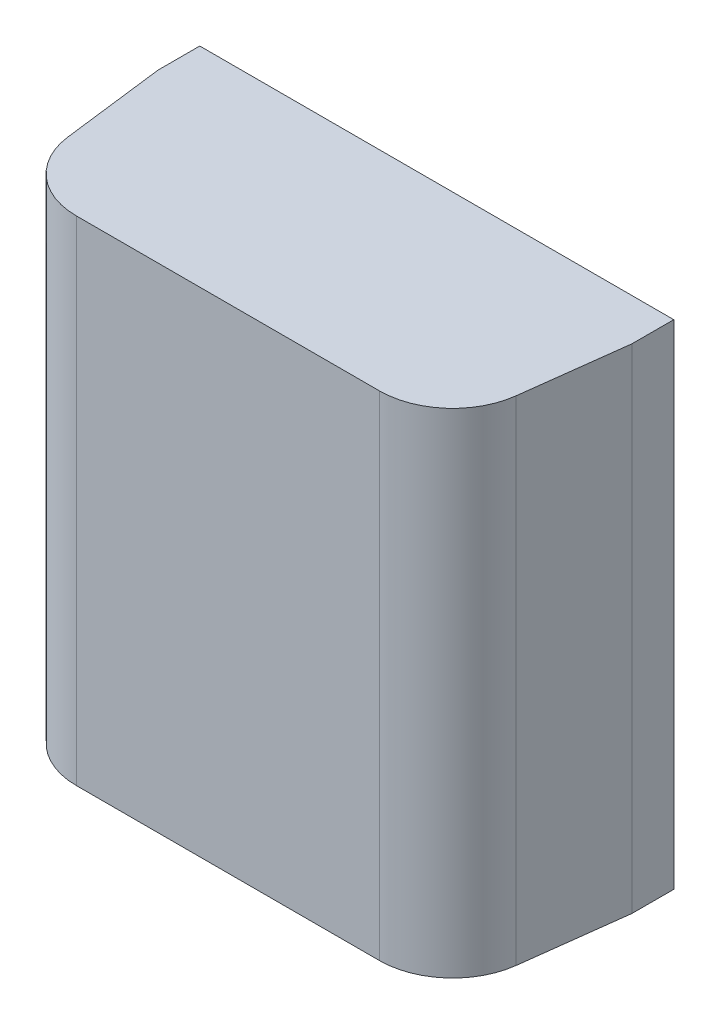
ISO-10303-21;
HEADER;
FILE_DESCRIPTION(('STEP AP214'),'2;1');
FILE_NAME('part.step','',(''),(''),'','','');
FILE_SCHEMA(('AUTOMOTIVE_DESIGN { 1 0 10303 214 1 1 1 1 }'));
ENDSEC;
DATA;
#1=APPLICATION_CONTEXT('core data for automotive mechanical design processes');
#2=APPLICATION_PROTOCOL_DEFINITION('international standard','automotive_design',2000,#1);
#3=PRODUCT_CONTEXT('',#1,'mechanical');
#4=PRODUCT('Part','Part','',(#3));
#5=PRODUCT_RELATED_PRODUCT_CATEGORY('part','',(#4));
#6=PRODUCT_DEFINITION_FORMATION('','',#4);
#7=PRODUCT_DEFINITION_CONTEXT('part definition',#1,'design');
#8=PRODUCT_DEFINITION('design','',#6,#7);
#9=PRODUCT_DEFINITION_SHAPE('','',#8);
#10=(LENGTH_UNIT() NAMED_UNIT(*) SI_UNIT(.MILLI.,.METRE.));
#11=(NAMED_UNIT(*) PLANE_ANGLE_UNIT() SI_UNIT($,.RADIAN.));
#12=(NAMED_UNIT(*) SI_UNIT($,.STERADIAN.) SOLID_ANGLE_UNIT());
#13=UNCERTAINTY_MEASURE_WITH_UNIT(LENGTH_MEASURE(1.E-05),#10,'distance_accuracy_value','');
#14=(GEOMETRIC_REPRESENTATION_CONTEXT(3) GLOBAL_UNCERTAINTY_ASSIGNED_CONTEXT((#13)) GLOBAL_UNIT_ASSIGNED_CONTEXT((#10,
#11,#12)) REPRESENTATION_CONTEXT('',''));
#15=CARTESIAN_POINT('',(0.,0.,0.));
#16=DIRECTION('',(0.,0.,1.));
#17=DIRECTION('',(1.,0.,0.));
#18=AXIS2_PLACEMENT_3D('',#15,#16,#17);
#19=CARTESIAN_POINT('',(0.362934712614328,-0.14766176900041,0.875));
#20=DIRECTION('',(0.,-1.,0.));
#21=DIRECTION('',(0.661802563235741,0.,0.749678175815866));
#22=AXIS2_PLACEMENT_3D('',#19,#20,#21);
#23=CYLINDRICAL_SURFACE('',#22,0.175);
#24=CARTESIAN_POINT('',(0.362934712614328,-0.590647076001639,0.875));
#25=DIRECTION('',(0.,1.,0.));
#26=DIRECTION('',(0.661802563235741,0.,0.749678175815866));
#27=AXIS2_PLACEMENT_3D('',#24,#25,#26);
#28=CIRCLE('',#27,0.175);
#29=CARTESIAN_POINT('',(0.362934712614328,-0.590647076001639,1.05));
#30=VERTEX_POINT('',#29);
#31=CARTESIAN_POINT('',(0.53658334103922,-0.590647076001639,0.896706078553112));
#32=VERTEX_POINT('',#31);
#33=EDGE_CURVE('E11',#30,#32,#28,.T.);
#34=ORIENTED_EDGE('',*,*,#33,.T.);
#35=DIRECTION('',(0.,1.,0.));
#36=VECTOR('',#35,1.);
#37=CARTESIAN_POINT('',(0.53658334103922,-0.14766176900041,0.896706078553112));
#38=LINE('',#37,#36);
#39=CARTESIAN_POINT('',(0.53658334103922,0.590647076001639,0.896706078553112));
#40=VERTEX_POINT('',#39);
#41=EDGE_CURVE('E25',#32,#40,#38,.T.);
#42=ORIENTED_EDGE('',*,*,#41,.T.);
#43=CARTESIAN_POINT('',(0.362934712614328,0.590647076001639,0.875));
#44=DIRECTION('',(0.,-1.,0.));
#45=DIRECTION('',(0.661802563235741,0.,0.749678175815866));
#46=AXIS2_PLACEMENT_3D('',#43,#44,#45);
#47=CIRCLE('',#46,0.175);
#48=CARTESIAN_POINT('',(0.362934712614328,0.590647076001639,1.05));
#49=VERTEX_POINT('',#48);
#50=EDGE_CURVE('E48',#40,#49,#47,.T.);
#51=ORIENTED_EDGE('',*,*,#50,.T.);
#52=DIRECTION('',(0.,-1.,0.));
#53=VECTOR('',#52,1.);
#54=CARTESIAN_POINT('',(0.362934712614328,-0.14766176900041,1.05));
#55=LINE('',#54,#53);
#56=EDGE_CURVE('E146',#49,#30,#55,.T.);
#57=ORIENTED_EDGE('',*,*,#56,.T.);
#58=EDGE_LOOP('',(#34,#42,#51,#57));
#59=FACE_BOUND('',#58,.T.);
#60=ADVANCED_FACE('F16',(#59),#23,.T.);
#61=CARTESIAN_POINT('',(-0.567421600858359,-0.590647076001639,0.55));
#62=DIRECTION('',(0.,-1.,0.));
#63=DIRECTION('',(0.,0.,-1.));
#64=AXIS2_PLACEMENT_3D('',#61,#62,#63);
#65=PLANE('',#64);
#66=ORIENTED_EDGE('',*,*,#33,.F.);
#67=DIRECTION('',(1.,0.,0.));
#68=VECTOR('',#67,1.);
#69=CARTESIAN_POINT('',(0.567421600858359,-0.590647076001639,1.05));
#70=LINE('',#69,#68);
#71=CARTESIAN_POINT('',(-0.362934712614328,-0.590647076001639,1.05));
#72=VERTEX_POINT('',#71);
#73=EDGE_CURVE('E154',#72,#30,#70,.T.);
#74=ORIENTED_EDGE('',*,*,#73,.F.);
#75=CARTESIAN_POINT('',(-0.362934712614328,-0.590647076001639,0.875));
#76=DIRECTION('',(0.,1.,0.));
#77=DIRECTION('',(-0.661802563235741,0.,0.749678175815866));
#78=AXIS2_PLACEMENT_3D('',#75,#76,#77);
#79=CIRCLE('',#78,0.175);
#80=CARTESIAN_POINT('',(-0.53658334103922,-0.590647076001639,0.896706078553112));
#81=VERTEX_POINT('',#80);
#82=EDGE_CURVE('E157',#81,#72,#79,.T.);
#83=ORIENTED_EDGE('',*,*,#82,.F.);
#84=DIRECTION('',(0.124034734589209,0.,0.992277876713668));
#85=VECTOR('',#84,1.);
#86=CARTESIAN_POINT('',(-0.561075447012205,-0.590647076001639,0.700769230769231));
#87=LINE('',#86,#85);
#88=CARTESIAN_POINT('',(-0.567421600858359,-0.590647076001639,0.65));
#89=VERTEX_POINT('',#88);
#90=EDGE_CURVE('E130',#89,#81,#87,.T.);
#91=ORIENTED_EDGE('',*,*,#90,.F.);
#92=DIRECTION('',(0.,0.,1.));
#93=VECTOR('',#92,1.);
#94=CARTESIAN_POINT('',(-0.567421600858359,-0.590647076001639,0.55));
#95=LINE('',#94,#93);
#96=CARTESIAN_POINT('',(-0.567421600858359,-0.590647076001639,0.55));
#97=VERTEX_POINT('',#96);
#98=EDGE_CURVE('E114',#97,#89,#95,.T.);
#99=ORIENTED_EDGE('',*,*,#98,.F.);
#100=DIRECTION('',(-1.,0.,0.));
#101=VECTOR('',#100,1.);
#102=CARTESIAN_POINT('',(0.567421600858359,-0.590647076001639,0.55));
#103=LINE('',#102,#101);
#104=CARTESIAN_POINT('',(0.567421600858359,-0.590647076001639,0.55));
#105=VERTEX_POINT('',#104);
#106=EDGE_CURVE('E119',#105,#97,#103,.T.);
#107=ORIENTED_EDGE('',*,*,#106,.F.);
#108=DIRECTION('',(0.,0.,1.));
#109=VECTOR('',#108,1.);
#110=CARTESIAN_POINT('',(0.567421600858359,-0.590647076001639,0.55));
#111=LINE('',#110,#109);
#112=CARTESIAN_POINT('',(0.567421600858359,-0.590647076001639,0.65));
#113=VERTEX_POINT('',#112);
#114=EDGE_CURVE('E149',#105,#113,#111,.T.);
#115=ORIENTED_EDGE('',*,*,#114,.T.);
#116=DIRECTION('',(0.124034734589209,0.,-0.992277876713668));
#117=VECTOR('',#116,1.);
#118=CARTESIAN_POINT('',(0.552345883922077,-0.590647076001639,0.77060573549026));
#119=LINE('',#118,#117);
#120=EDGE_CURVE('E162',#32,#113,#119,.T.);
#121=ORIENTED_EDGE('',*,*,#120,.F.);
#122=EDGE_LOOP('',(#66,#74,#83,#91,#99,#107,#115,#121));
#123=FACE_BOUND('',#122,.T.);
#124=ADVANCED_FACE('F128',(#123),#65,.T.);
#125=CARTESIAN_POINT('',(0.,0.,1.05));
#126=DIRECTION('',(0.,0.,1.));
#127=DIRECTION('',(1.,0.,0.));
#128=AXIS2_PLACEMENT_3D('',#125,#126,#127);
#129=PLANE('',#128);
#130=ORIENTED_EDGE('',*,*,#56,.F.);
#131=DIRECTION('',(-1.,0.,0.));
#132=VECTOR('',#131,1.);
#133=CARTESIAN_POINT('',(-0.567421600858359,0.590647076001639,1.05));
#134=LINE('',#133,#132);
#135=CARTESIAN_POINT('',(-0.362934712614328,0.590647076001639,1.05));
#136=VERTEX_POINT('',#135);
#137=EDGE_CURVE('E150',#49,#136,#134,.T.);
#138=ORIENTED_EDGE('',*,*,#137,.T.);
#139=DIRECTION('',(0.,1.,0.));
#140=VECTOR('',#139,1.);
#141=CARTESIAN_POINT('',(-0.362934712614328,0.14766176900041,1.05));
#142=LINE('',#141,#140);
#143=EDGE_CURVE('E161',#72,#136,#142,.T.);
#144=ORIENTED_EDGE('',*,*,#143,.F.);
#145=ORIENTED_EDGE('',*,*,#73,.T.);
#146=EDGE_LOOP('',(#130,#138,#144,#145));
#147=FACE_BOUND('',#146,.T.);
#148=ADVANCED_FACE('F209',(#147),#129,.T.);
#149=CARTESIAN_POINT('',(-0.362934712614328,0.14766176900041,0.875));
#150=DIRECTION('',(0.,1.,0.));
#151=DIRECTION('',(-0.661802563235741,0.,0.749678175815866));
#152=AXIS2_PLACEMENT_3D('',#149,#150,#151);
#153=CYLINDRICAL_SURFACE('',#152,0.175);
#154=CARTESIAN_POINT('',(-0.362934712614328,0.590647076001639,0.875));
#155=DIRECTION('',(0.,-1.,0.));
#156=DIRECTION('',(-0.661802563235741,0.,0.749678175815866));
#157=AXIS2_PLACEMENT_3D('',#154,#155,#156);
#158=CIRCLE('',#157,0.175);
#159=CARTESIAN_POINT('',(-0.53658334103922,0.590647076001639,0.896706078553112));
#160=VERTEX_POINT('',#159);
#161=EDGE_CURVE('E169',#136,#160,#158,.T.);
#162=ORIENTED_EDGE('',*,*,#161,.T.);
#163=DIRECTION('',(0.,-1.,0.));
#164=VECTOR('',#163,1.);
#165=CARTESIAN_POINT('',(-0.53658334103922,0.14766176900041,0.896706078553112));
#166=LINE('',#165,#164);
#167=EDGE_CURVE('E160',#160,#81,#166,.T.);
#168=ORIENTED_EDGE('',*,*,#167,.T.);
#169=ORIENTED_EDGE('',*,*,#82,.T.);
#170=ORIENTED_EDGE('',*,*,#143,.T.);
#171=EDGE_LOOP('',(#162,#168,#169,#170));
#172=FACE_BOUND('',#171,.T.);
#173=ADVANCED_FACE('F212',(#172),#153,.T.);
#174=CARTESIAN_POINT('',(0.542421600858359,-0.295323538000819,0.85));
#175=DIRECTION('',(0.992277876713668,0.,0.124034734589209));
#176=DIRECTION('',(0.,-1.,0.));
#177=AXIS2_PLACEMENT_3D('',#174,#175,#176);
#178=PLANE('',#177);
#179=ORIENTED_EDGE('',*,*,#41,.F.);
#180=ORIENTED_EDGE('',*,*,#120,.T.);
#181=DIRECTION('',(0.,1.,0.));
#182=VECTOR('',#181,1.);
#183=CARTESIAN_POINT('',(0.567421600858359,-0.295323538000819,0.65));
#184=LINE('',#183,#182);
#185=CARTESIAN_POINT('',(0.567421600858359,0.590647076001639,0.65));
#186=VERTEX_POINT('',#185);
#187=EDGE_CURVE('E165',#113,#186,#184,.T.);
#188=ORIENTED_EDGE('',*,*,#187,.T.);
#189=DIRECTION('',(-0.124034734589209,0.,0.992277876713668));
#190=VECTOR('',#189,1.);
#191=CARTESIAN_POINT('',(0.561075447012205,0.590647076001639,0.700769230769231));
#192=LINE('',#191,#190);
#193=EDGE_CURVE('E19',#186,#40,#192,.T.);
#194=ORIENTED_EDGE('',*,*,#193,.T.);
#195=EDGE_LOOP('',(#179,#180,#188,#194));
#196=FACE_BOUND('',#195,.T.);
#197=ADVANCED_FACE('F203',(#196),#178,.T.);
#198=CARTESIAN_POINT('',(-0.542421600858359,0.295323538000819,0.85));
#199=DIRECTION('',(-0.992277876713668,0.,0.124034734589209));
#200=DIRECTION('',(0.,1.,0.));
#201=AXIS2_PLACEMENT_3D('',#198,#199,#200);
#202=PLANE('',#201);
#203=ORIENTED_EDGE('',*,*,#167,.F.);
#204=DIRECTION('',(-0.124034734589209,0.,-0.992277876713668));
#205=VECTOR('',#204,1.);
#206=CARTESIAN_POINT('',(-0.552345883922077,0.590647076001639,0.77060573549026));
#207=LINE('',#206,#205);
#208=CARTESIAN_POINT('',(-0.567421600858359,0.590647076001639,0.65));
#209=VERTEX_POINT('',#208);
#210=EDGE_CURVE('E174',#160,#209,#207,.T.);
#211=ORIENTED_EDGE('',*,*,#210,.T.);
#212=DIRECTION('',(0.,-1.,0.));
#213=VECTOR('',#212,1.);
#214=CARTESIAN_POINT('',(-0.567421600858359,0.295323538000819,0.65));
#215=LINE('',#214,#213);
#216=EDGE_CURVE('E65',#209,#89,#215,.T.);
#217=ORIENTED_EDGE('',*,*,#216,.T.);
#218=ORIENTED_EDGE('',*,*,#90,.T.);
#219=EDGE_LOOP('',(#203,#211,#217,#218));
#220=FACE_BOUND('',#219,.T.);
#221=ADVANCED_FACE('F214',(#220),#202,.T.);
#222=CARTESIAN_POINT('',(0.567421600858359,-0.590647076001639,0.55));
#223=DIRECTION('',(1.,0.,0.));
#224=DIRECTION('',(0.,1.,0.));
#225=AXIS2_PLACEMENT_3D('',#222,#223,#224);
#226=PLANE('',#225);
#227=ORIENTED_EDGE('',*,*,#187,.F.);
#228=ORIENTED_EDGE('',*,*,#114,.F.);
#229=DIRECTION('',(0.,-1.,0.));
#230=VECTOR('',#229,1.);
#231=CARTESIAN_POINT('',(0.567421600858359,0.590647076001639,0.55));
#232=LINE('',#231,#230);
#233=CARTESIAN_POINT('',(0.567421600858359,0.590647076001639,0.55));
#234=VERTEX_POINT('',#233);
#235=EDGE_CURVE('E79',#234,#105,#232,.T.);
#236=ORIENTED_EDGE('',*,*,#235,.F.);
#237=DIRECTION('',(0.,0.,1.));
#238=VECTOR('',#237,1.);
#239=CARTESIAN_POINT('',(0.567421600858359,0.590647076001639,0.55));
#240=LINE('',#239,#238);
#241=EDGE_CURVE('E132',#234,#186,#240,.T.);
#242=ORIENTED_EDGE('',*,*,#241,.T.);
#243=EDGE_LOOP('',(#227,#228,#236,#242));
#244=FACE_BOUND('',#243,.T.);
#245=ADVANCED_FACE('F202',(#244),#226,.T.);
#246=CARTESIAN_POINT('',(-0.567421600858359,0.590647076001639,0.55));
#247=DIRECTION('',(-1.,0.,0.));
#248=DIRECTION('',(0.,0.,1.));
#249=AXIS2_PLACEMENT_3D('',#246,#247,#248);
#250=PLANE('',#249);
#251=ORIENTED_EDGE('',*,*,#216,.F.);
#252=DIRECTION('',(0.,0.,1.));
#253=VECTOR('',#252,1.);
#254=CARTESIAN_POINT('',(-0.567421600858359,0.590647076001639,0.55));
#255=LINE('',#254,#253);
#256=CARTESIAN_POINT('',(-0.567421600858359,0.590647076001639,0.55));
#257=VERTEX_POINT('',#256);
#258=EDGE_CURVE('E133',#257,#209,#255,.T.);
#259=ORIENTED_EDGE('',*,*,#258,.F.);
#260=DIRECTION('',(0.,1.,0.));
#261=VECTOR('',#260,1.);
#262=CARTESIAN_POINT('',(-0.567421600858359,-0.590647076001639,0.55));
#263=LINE('',#262,#261);
#264=EDGE_CURVE('E122',#97,#257,#263,.T.);
#265=ORIENTED_EDGE('',*,*,#264,.F.);
#266=ORIENTED_EDGE('',*,*,#98,.T.);
#267=EDGE_LOOP('',(#251,#259,#265,#266));
#268=FACE_BOUND('',#267,.T.);
#269=ADVANCED_FACE('F135',(#268),#250,.T.);
#270=CARTESIAN_POINT('',(0.567421600858359,0.590647076001639,0.55));
#271=DIRECTION('',(0.,1.,0.));
#272=DIRECTION('',(1.,0.,0.));
#273=AXIS2_PLACEMENT_3D('',#270,#271,#272);
#274=PLANE('',#273);
#275=ORIENTED_EDGE('',*,*,#50,.F.);
#276=ORIENTED_EDGE('',*,*,#193,.F.);
#277=ORIENTED_EDGE('',*,*,#241,.F.);
#278=DIRECTION('',(1.,0.,0.));
#279=VECTOR('',#278,1.);
#280=CARTESIAN_POINT('',(-0.567421600858359,0.590647076001639,0.55));
#281=LINE('',#280,#279);
#282=EDGE_CURVE('E183',#257,#234,#281,.T.);
#283=ORIENTED_EDGE('',*,*,#282,.F.);
#284=ORIENTED_EDGE('',*,*,#258,.T.);
#285=ORIENTED_EDGE('',*,*,#210,.F.);
#286=ORIENTED_EDGE('',*,*,#161,.F.);
#287=ORIENTED_EDGE('',*,*,#137,.F.);
#288=EDGE_LOOP('',(#275,#276,#277,#283,#284,#285,#286,#287));
#289=FACE_BOUND('',#288,.T.);
#290=ADVANCED_FACE('F199',(#289),#274,.T.);
#291=CARTESIAN_POINT('',(0.,0.,0.55));
#292=DIRECTION('',(0.,0.,1.));
#293=DIRECTION('',(1.,0.,0.));
#294=AXIS2_PLACEMENT_3D('',#291,#292,#293);
#295=PLANE('',#294);
#296=ORIENTED_EDGE('',*,*,#282,.T.);
#297=ORIENTED_EDGE('',*,*,#235,.T.);
#298=ORIENTED_EDGE('',*,*,#106,.T.);
#299=ORIENTED_EDGE('',*,*,#264,.T.);
#300=EDGE_LOOP('',(#296,#297,#298,#299));
#301=FACE_BOUND('',#300,.T.);
#302=ADVANCED_FACE('F121',(#301),#295,.F.);
#303=CLOSED_SHELL('',(#60,#124,#148,#173,#197,#221,#245,#269,#290,#302));
#304=MANIFOLD_SOLID_BREP('B1',#303);
#305=ADVANCED_BREP_SHAPE_REPRESENTATION('',(#18,#304),#14);
#306=SHAPE_DEFINITION_REPRESENTATION(#9,#305);
ENDSEC;
END-ISO-10303-21;
